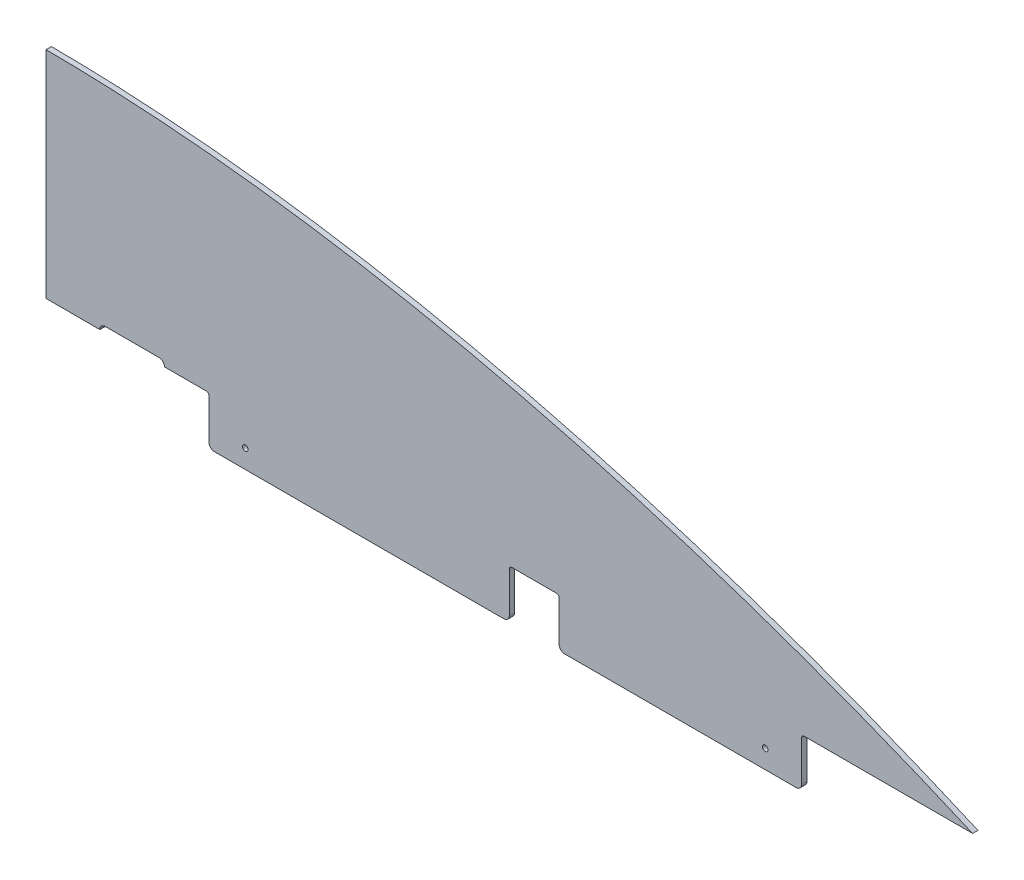
ISO-10303-21;
HEADER;
FILE_DESCRIPTION(('STEP AP214'),'2;1');
FILE_NAME('part.step','',(''),(''),'','','');
FILE_SCHEMA(('AUTOMOTIVE_DESIGN { 1 0 10303 214 1 1 1 1 }'));
ENDSEC;
DATA;
#1=APPLICATION_CONTEXT('core data for automotive mechanical design processes');
#2=APPLICATION_PROTOCOL_DEFINITION('international standard','automotive_design',2000,#1);
#3=PRODUCT_CONTEXT('',#1,'mechanical');
#4=PRODUCT('Part','Part','',(#3));
#5=PRODUCT_RELATED_PRODUCT_CATEGORY('part','',(#4));
#6=PRODUCT_DEFINITION_FORMATION('','',#4);
#7=PRODUCT_DEFINITION_CONTEXT('part definition',#1,'design');
#8=PRODUCT_DEFINITION('design','',#6,#7);
#9=PRODUCT_DEFINITION_SHAPE('','',#8);
#10=(LENGTH_UNIT() NAMED_UNIT(*) SI_UNIT(.MILLI.,.METRE.));
#11=(NAMED_UNIT(*) PLANE_ANGLE_UNIT() SI_UNIT($,.RADIAN.));
#12=(NAMED_UNIT(*) SI_UNIT($,.STERADIAN.) SOLID_ANGLE_UNIT());
#13=UNCERTAINTY_MEASURE_WITH_UNIT(LENGTH_MEASURE(1.E-05),#10,'distance_accuracy_value','');
#14=(GEOMETRIC_REPRESENTATION_CONTEXT(3) GLOBAL_UNCERTAINTY_ASSIGNED_CONTEXT((#13)) GLOBAL_UNIT_ASSIGNED_CONTEXT((#10,
#11,#12)) REPRESENTATION_CONTEXT('',''));
#15=CARTESIAN_POINT('',(0.,0.,0.));
#16=DIRECTION('',(0.,0.,1.));
#17=DIRECTION('',(1.,0.,0.));
#18=AXIS2_PLACEMENT_3D('',#15,#16,#17);
#19=CARTESIAN_POINT('',(566.574596477157,179.041017308607,0.));
#20=DIRECTION('',(0.,0.,1.));
#21=DIRECTION('',(1.,0.,0.));
#22=AXIS2_PLACEMENT_3D('',#19,#20,#21);
#23=PLANE('',#22);
#24=CARTESIAN_POINT('',(234.95,-35.3060000000001,0.));
#25=DIRECTION('',(0.,0.,-1.));
#26=DIRECTION('',(-1.,0.,0.));
#27=AXIS2_PLACEMENT_3D('',#24,#25,#26);
#28=CIRCLE('',#27,3.26389999999993);
#29=CARTESIAN_POINT('',(231.6861,-35.3060000000001,0.));
#30=VERTEX_POINT('',#29);
#31=EDGE_CURVE('E457',#30,#30,#28,.T.);
#32=ORIENTED_EDGE('',*,*,#31,.F.);
#33=EDGE_LOOP('',(#32));
#34=FACE_BOUND('',#33,.T.);
#35=DIRECTION('',(0.,-1.,0.));
#36=VECTOR('',#35,1.);
#37=CARTESIAN_POINT('',(546.1,-57.15,0.));
#38=LINE('',#37,#36);
#39=CARTESIAN_POINT('',(546.1,-3.17499999999999,0.));
#40=VERTEX_POINT('',#39);
#41=CARTESIAN_POINT('',(546.1,-50.8,0.));
#42=VERTEX_POINT('',#41);
#43=EDGE_CURVE('E423',#40,#42,#38,.T.);
#44=ORIENTED_EDGE('',*,*,#43,.T.);
#45=CARTESIAN_POINT('',(539.75,-50.8,0.));
#46=DIRECTION('',(0.,0.,1.));
#47=DIRECTION('',(1.,0.,0.));
#48=AXIS2_PLACEMENT_3D('',#45,#46,#47);
#49=CIRCLE('',#48,6.35);
#50=CARTESIAN_POINT('',(539.75,-57.15,0.));
#51=VERTEX_POINT('',#50);
#52=EDGE_CURVE('E405',#42,#51,#49,.F.);
#53=ORIENTED_EDGE('',*,*,#52,.T.);
#54=DIRECTION('',(-1.,0.,0.));
#55=VECTOR('',#54,1.);
#56=CARTESIAN_POINT('',(192.0875,-57.15,0.));
#57=LINE('',#56,#55);
#58=CARTESIAN_POINT('',(198.4375,-57.15,0.));
#59=VERTEX_POINT('',#58);
#60=EDGE_CURVE('E436',#51,#59,#57,.T.);
#61=ORIENTED_EDGE('',*,*,#60,.T.);
#62=CARTESIAN_POINT('',(198.4375,-50.8,0.));
#63=DIRECTION('',(0.,0.,1.));
#64=DIRECTION('',(1.,0.,0.));
#65=AXIS2_PLACEMENT_3D('',#62,#63,#64);
#66=CIRCLE('',#65,6.35);
#67=CARTESIAN_POINT('',(192.0875,-50.8,0.));
#68=VERTEX_POINT('',#67);
#69=EDGE_CURVE('E53',#59,#68,#66,.F.);
#70=ORIENTED_EDGE('',*,*,#69,.T.);
#71=DIRECTION('',(0.,1.,0.));
#72=VECTOR('',#71,1.);
#73=CARTESIAN_POINT('',(192.0875,0.,0.));
#74=LINE('',#73,#72);
#75=CARTESIAN_POINT('',(192.0875,-3.175,0.));
#76=VERTEX_POINT('',#75);
#77=EDGE_CURVE('E420',#68,#76,#74,.T.);
#78=ORIENTED_EDGE('',*,*,#77,.T.);
#79=CARTESIAN_POINT('',(188.9125,-3.175,0.));
#80=DIRECTION('',(0.,0.,1.));
#81=DIRECTION('',(1.,0.,0.));
#82=AXIS2_PLACEMENT_3D('',#79,#80,#81);
#83=CIRCLE('',#82,3.175);
#84=CARTESIAN_POINT('',(188.9125,0.,0.));
#85=VERTEX_POINT('',#84);
#86=EDGE_CURVE('E194',#76,#85,#83,.T.);
#87=ORIENTED_EDGE('',*,*,#86,.T.);
#88=DIRECTION('',(1.,0.,0.));
#89=VECTOR('',#88,1.);
#90=CARTESIAN_POINT('',(0.,0.,0.));
#91=LINE('',#90,#89);
#92=CARTESIAN_POINT('',(139.7,0.,0.));
#93=VERTEX_POINT('',#92);
#94=EDGE_CURVE('E186',#93,#85,#91,.T.);
#95=ORIENTED_EDGE('',*,*,#94,.F.);
#96=CARTESIAN_POINT('',(133.35,0.,0.));
#97=DIRECTION('',(0.,0.,-1.));
#98=DIRECTION('',(-1.,0.,0.));
#99=AXIS2_PLACEMENT_3D('',#96,#97,#98);
#100=CIRCLE('',#99,6.35000000000017);
#101=CARTESIAN_POINT('',(133.35,6.35000000000018,0.));
#102=VERTEX_POINT('',#101);
#103=EDGE_CURVE('E191',#102,#93,#100,.T.);
#104=ORIENTED_EDGE('',*,*,#103,.F.);
#105=DIRECTION('',(1.,0.,0.));
#106=VECTOR('',#105,1.);
#107=CARTESIAN_POINT('',(69.85,6.35000000000017,0.));
#108=LINE('',#107,#106);
#109=CARTESIAN_POINT('',(69.85,6.35000000000016,0.));
#110=VERTEX_POINT('',#109);
#111=EDGE_CURVE('E220',#110,#102,#108,.T.);
#112=ORIENTED_EDGE('',*,*,#111,.F.);
#113=CARTESIAN_POINT('',(69.85,0.,0.));
#114=DIRECTION('',(0.,0.,-1.));
#115=DIRECTION('',(1.,0.,0.));
#116=AXIS2_PLACEMENT_3D('',#113,#114,#115);
#117=CIRCLE('',#116,6.35000000000008);
#118=CARTESIAN_POINT('',(63.4999999999999,0.,0.));
#119=VERTEX_POINT('',#118);
#120=EDGE_CURVE('E222',#119,#110,#117,.T.);
#121=ORIENTED_EDGE('',*,*,#120,.F.);
#122=CARTESIAN_POINT('',(0.,0.,0.));
#123=VERTEX_POINT('',#122);
#124=EDGE_CURVE('E198',#123,#119,#91,.T.);
#125=ORIENTED_EDGE('',*,*,#124,.F.);
#126=DIRECTION('',(0.,-1.,0.));
#127=VECTOR('',#126,1.);
#128=CARTESIAN_POINT('',(0.,254.,0.));
#129=LINE('',#128,#127);
#130=CARTESIAN_POINT('',(0.,254.,0.));
#131=VERTEX_POINT('',#130);
#132=EDGE_CURVE('E337',#131,#123,#129,.T.);
#133=ORIENTED_EDGE('',*,*,#132,.F.);
#134=CARTESIAN_POINT('',(1092.2,-3.05594159067454E-13,0.));
#135=CARTESIAN_POINT('',(770.285770074945,140.499670678071,0.));
#136=CARTESIAN_POINT('',(376.513153864139,252.276375478215,0.));
#137=CARTESIAN_POINT('',(0.,254.,0.));
#138=B_SPLINE_CURVE_WITH_KNOTS('',3,(#134,#135,#136,#137),.UNSPECIFIED.,.F.,.F.,(4,4),(0.,1.),.UNSPECIFIED.);
#139=CARTESIAN_POINT('',(1092.2,0.,0.));
#140=VERTEX_POINT('',#139);
#141=EDGE_CURVE('E235',#140,#131,#138,.T.);
#142=ORIENTED_EDGE('',*,*,#141,.F.);
#143=CARTESIAN_POINT('',(893.7625,0.,0.));
#144=VERTEX_POINT('',#143);
#145=EDGE_CURVE('E199',#144,#140,#91,.T.);
#146=ORIENTED_EDGE('',*,*,#145,.F.);
#147=CARTESIAN_POINT('',(893.7625,-3.175,0.));
#148=DIRECTION('',(0.,0.,1.));
#149=DIRECTION('',(1.,0.,0.));
#150=AXIS2_PLACEMENT_3D('',#147,#148,#149);
#151=CIRCLE('',#150,3.175);
#152=CARTESIAN_POINT('',(890.5875,-3.175,0.));
#153=VERTEX_POINT('',#152);
#154=EDGE_CURVE('E381',#144,#153,#151,.T.);
#155=ORIENTED_EDGE('',*,*,#154,.T.);
#156=DIRECTION('',(0.,-1.,0.));
#157=VECTOR('',#156,1.);
#158=CARTESIAN_POINT('',(890.5875,0.,0.));
#159=LINE('',#158,#157);
#160=CARTESIAN_POINT('',(890.5875,-50.8,0.));
#161=VERTEX_POINT('',#160);
#162=EDGE_CURVE('E434',#153,#161,#159,.T.);
#163=ORIENTED_EDGE('',*,*,#162,.T.);
#164=CARTESIAN_POINT('',(884.2375,-50.8,0.));
#165=DIRECTION('',(0.,0.,1.));
#166=DIRECTION('',(1.,0.,0.));
#167=AXIS2_PLACEMENT_3D('',#164,#165,#166);
#168=CIRCLE('',#167,6.35);
#169=CARTESIAN_POINT('',(884.2375,-57.15,0.));
#170=VERTEX_POINT('',#169);
#171=EDGE_CURVE('E400',#161,#170,#168,.F.);
#172=ORIENTED_EDGE('',*,*,#171,.T.);
#173=CARTESIAN_POINT('',(611.1875,-57.15,0.));
#174=VERTEX_POINT('',#173);
#175=EDGE_CURVE('E216',#170,#174,#57,.T.);
#176=ORIENTED_EDGE('',*,*,#175,.T.);
#177=CARTESIAN_POINT('',(611.1875,-50.8,0.));
#178=DIRECTION('',(0.,0.,1.));
#179=DIRECTION('',(1.,0.,0.));
#180=AXIS2_PLACEMENT_3D('',#177,#178,#179);
#181=CIRCLE('',#180,6.35);
#182=CARTESIAN_POINT('',(604.8375,-50.8,0.));
#183=VERTEX_POINT('',#182);
#184=EDGE_CURVE('E403',#174,#183,#181,.F.);
#185=ORIENTED_EDGE('',*,*,#184,.T.);
#186=DIRECTION('',(0.,1.,0.));
#187=VECTOR('',#186,1.);
#188=CARTESIAN_POINT('',(604.8375,-57.15,0.));
#189=LINE('',#188,#187);
#190=CARTESIAN_POINT('',(604.8375,-3.175,0.));
#191=VERTEX_POINT('',#190);
#192=EDGE_CURVE('E445',#183,#191,#189,.T.);
#193=ORIENTED_EDGE('',*,*,#192,.T.);
#194=CARTESIAN_POINT('',(601.6625,-3.175,0.));
#195=DIRECTION('',(0.,0.,1.));
#196=DIRECTION('',(1.,0.,0.));
#197=AXIS2_PLACEMENT_3D('',#194,#195,#196);
#198=CIRCLE('',#197,3.175);
#199=CARTESIAN_POINT('',(601.6625,0.,0.));
#200=VERTEX_POINT('',#199);
#201=EDGE_CURVE('E377',#191,#200,#198,.T.);
#202=ORIENTED_EDGE('',*,*,#201,.T.);
#203=DIRECTION('',(-1.,0.,0.));
#204=VECTOR('',#203,1.);
#205=CARTESIAN_POINT('',(604.8375,0.,0.));
#206=LINE('',#205,#204);
#207=CARTESIAN_POINT('',(549.275,0.,0.));
#208=VERTEX_POINT('',#207);
#209=EDGE_CURVE('E428',#200,#208,#206,.T.);
#210=ORIENTED_EDGE('',*,*,#209,.T.);
#211=CARTESIAN_POINT('',(549.275,-3.17499999999999,0.));
#212=DIRECTION('',(0.,0.,1.));
#213=DIRECTION('',(1.,0.,0.));
#214=AXIS2_PLACEMENT_3D('',#211,#212,#213);
#215=CIRCLE('',#214,3.175);
#216=EDGE_CURVE('E372',#208,#40,#215,.T.);
#217=ORIENTED_EDGE('',*,*,#216,.T.);
#218=EDGE_LOOP('',(#44,#53,#61,#70,#78,#87,#95,#104,#112,#121,#125,#133,#142,#146,#155,#163,
#172,#176,#185,#193,#202,#210,#217));
#219=FACE_BOUND('',#218,.T.);
#220=CARTESIAN_POINT('',(847.725,-35.3060000000001,0.));
#221=DIRECTION('',(0.,0.,-1.));
#222=DIRECTION('',(-1.,0.,0.));
#223=AXIS2_PLACEMENT_3D('',#220,#221,#222);
#224=CIRCLE('',#223,3.26389999999999);
#225=CARTESIAN_POINT('',(844.4611,-35.3060000000001,0.));
#226=VERTEX_POINT('',#225);
#227=EDGE_CURVE('E463',#226,#226,#224,.T.);
#228=ORIENTED_EDGE('',*,*,#227,.F.);
#229=EDGE_LOOP('',(#228));
#230=FACE_BOUND('',#229,.T.);
#231=ADVANCED_FACE('F32',(#34,#219,#230),#23,.F.);
#232=CARTESIAN_POINT('',(192.0875,-57.15,-700.834054894595));
#233=DIRECTION('',(0.,-1.,0.));
#234=DIRECTION('',(0.,0.,-1.));
#235=AXIS2_PLACEMENT_3D('',#232,#233,#234);
#236=PLANE('',#235);
#237=DIRECTION('',(1.,0.,0.));
#238=VECTOR('',#237,1.);
#239=CARTESIAN_POINT('',(192.0875,-57.15,6.35));
#240=LINE('',#239,#238);
#241=CARTESIAN_POINT('',(611.1875,-57.15,6.35));
#242=VERTEX_POINT('',#241);
#243=CARTESIAN_POINT('',(884.2375,-57.15,6.35));
#244=VERTEX_POINT('',#243);
#245=EDGE_CURVE('E422',#242,#244,#240,.T.);
#246=ORIENTED_EDGE('',*,*,#245,.F.);
#247=DIRECTION('',(0.,0.,1.));
#248=VECTOR('',#247,1.);
#249=CARTESIAN_POINT('',(611.1875,-57.15,0.));
#250=LINE('',#249,#248);
#251=EDGE_CURVE('E413',#242,#174,#250,.F.);
#252=ORIENTED_EDGE('',*,*,#251,.T.);
#253=ORIENTED_EDGE('',*,*,#175,.F.);
#254=DIRECTION('',(0.,0.,1.));
#255=VECTOR('',#254,1.);
#256=CARTESIAN_POINT('',(884.2375,-57.15,-700.834054894595));
#257=LINE('',#256,#255);
#258=EDGE_CURVE('E410',#170,#244,#257,.T.);
#259=ORIENTED_EDGE('',*,*,#258,.T.);
#260=EDGE_LOOP('',(#246,#252,#253,#259));
#261=FACE_BOUND('',#260,.T.);
#262=ADVANCED_FACE('F289',(#261),#236,.T.);
#263=CARTESIAN_POINT('',(0.,0.,6.35));
#264=DIRECTION('',(0.,1.,0.));
#265=DIRECTION('',(0.,0.,1.));
#266=AXIS2_PLACEMENT_3D('',#263,#264,#265);
#267=PLANE('',#266);
#268=ORIENTED_EDGE('',*,*,#94,.T.);
#269=DIRECTION('',(0.,0.,1.));
#270=VECTOR('',#269,1.);
#271=CARTESIAN_POINT('',(188.9125,0.,6.35));
#272=LINE('',#271,#270);
#273=CARTESIAN_POINT('',(188.9125,0.,6.35));
#274=VERTEX_POINT('',#273);
#275=EDGE_CURVE('E365',#85,#274,#272,.T.);
#276=ORIENTED_EDGE('',*,*,#275,.T.);
#277=DIRECTION('',(1.,0.,0.));
#278=VECTOR('',#277,1.);
#279=CARTESIAN_POINT('',(0.,0.,6.35));
#280=LINE('',#279,#278);
#281=CARTESIAN_POINT('',(139.7,0.,6.35));
#282=VERTEX_POINT('',#281);
#283=EDGE_CURVE('E206',#282,#274,#280,.T.);
#284=ORIENTED_EDGE('',*,*,#283,.F.);
#285=DIRECTION('',(0.,0.,1.));
#286=VECTOR('',#285,1.);
#287=CARTESIAN_POINT('',(139.7,0.,0.));
#288=LINE('',#287,#286);
#289=EDGE_CURVE('E203',#93,#282,#288,.T.);
#290=ORIENTED_EDGE('',*,*,#289,.F.);
#291=EDGE_LOOP('',(#268,#276,#284,#290));
#292=FACE_BOUND('',#291,.T.);
#293=ADVANCED_FACE('F204',(#292),#267,.F.);
#294=DIRECTION('',(0.,0.,1.));
#295=VECTOR('',#294,1.);
#296=CARTESIAN_POINT('',(63.5,0.,0.));
#297=LINE('',#296,#295);
#298=CARTESIAN_POINT('',(63.4999999999999,0.,6.35));
#299=VERTEX_POINT('',#298);
#300=EDGE_CURVE('E225',#119,#299,#297,.T.);
#301=ORIENTED_EDGE('',*,*,#300,.T.);
#302=CARTESIAN_POINT('',(0.,0.,6.35));
#303=VERTEX_POINT('',#302);
#304=EDGE_CURVE('E315',#303,#299,#280,.T.);
#305=ORIENTED_EDGE('',*,*,#304,.F.);
#306=DIRECTION('',(0.,0.,-1.));
#307=VECTOR('',#306,1.);
#308=CARTESIAN_POINT('',(0.,0.,6.35));
#309=LINE('',#308,#307);
#310=EDGE_CURVE('E344',#303,#123,#309,.T.);
#311=ORIENTED_EDGE('',*,*,#310,.T.);
#312=ORIENTED_EDGE('',*,*,#124,.T.);
#313=EDGE_LOOP('',(#301,#305,#311,#312));
#314=FACE_BOUND('',#313,.T.);
#315=ADVANCED_FACE('F301',(#314),#267,.F.);
#316=CARTESIAN_POINT('',(893.7625,0.,6.35));
#317=VERTEX_POINT('',#316);
#318=CARTESIAN_POINT('',(1092.2,0.,6.35));
#319=VERTEX_POINT('',#318);
#320=EDGE_CURVE('E324',#317,#319,#280,.T.);
#321=ORIENTED_EDGE('',*,*,#320,.F.);
#322=DIRECTION('',(0.,0.,1.));
#323=VECTOR('',#322,1.);
#324=CARTESIAN_POINT('',(893.7625,0.,6.35));
#325=LINE('',#324,#323);
#326=EDGE_CURVE('E363',#317,#144,#325,.F.);
#327=ORIENTED_EDGE('',*,*,#326,.T.);
#328=ORIENTED_EDGE('',*,*,#145,.T.);
#329=DIRECTION('',(0.,0.,-1.));
#330=VECTOR('',#329,1.);
#331=CARTESIAN_POINT('',(1092.2,0.,6.35));
#332=LINE('',#331,#330);
#333=EDGE_CURVE('E323',#319,#140,#332,.T.);
#334=ORIENTED_EDGE('',*,*,#333,.F.);
#335=EDGE_LOOP('',(#321,#327,#328,#334));
#336=FACE_BOUND('',#335,.T.);
#337=ADVANCED_FACE('F303',(#336),#267,.F.);
#338=CARTESIAN_POINT('',(566.574596477157,179.041017308607,6.35));
#339=DIRECTION('',(0.,0.,1.));
#340=DIRECTION('',(1.,0.,0.));
#341=AXIS2_PLACEMENT_3D('',#338,#339,#340);
#342=PLANE('',#341);
#343=CARTESIAN_POINT('',(847.725,-35.3060000000001,6.34999999999997));
#344=DIRECTION('',(0.,0.,-1.));
#345=DIRECTION('',(-1.,0.,0.));
#346=AXIS2_PLACEMENT_3D('',#343,#344,#345);
#347=CIRCLE('',#346,3.26389999999999);
#348=CARTESIAN_POINT('',(844.4611,-35.3060000000001,6.34999999999997));
#349=VERTEX_POINT('',#348);
#350=EDGE_CURVE('E460',#349,#349,#347,.T.);
#351=ORIENTED_EDGE('',*,*,#350,.T.);
#352=EDGE_LOOP('',(#351));
#353=FACE_BOUND('',#352,.T.);
#354=CARTESIAN_POINT('',(234.95,-35.3060000000001,6.34999999999997));
#355=DIRECTION('',(0.,0.,-1.));
#356=DIRECTION('',(-1.,0.,0.));
#357=AXIS2_PLACEMENT_3D('',#354,#355,#356);
#358=CIRCLE('',#357,3.26389999999993);
#359=CARTESIAN_POINT('',(231.6861,-35.3060000000001,6.34999999999997));
#360=VERTEX_POINT('',#359);
#361=EDGE_CURVE('E450',#360,#360,#358,.T.);
#362=ORIENTED_EDGE('',*,*,#361,.T.);
#363=EDGE_LOOP('',(#362));
#364=FACE_BOUND('',#363,.T.);
#365=CARTESIAN_POINT('',(198.4375,-57.15,6.35));
#366=VERTEX_POINT('',#365);
#367=CARTESIAN_POINT('',(539.75,-57.15,6.35));
#368=VERTEX_POINT('',#367);
#369=EDGE_CURVE('E426',#366,#368,#240,.T.);
#370=ORIENTED_EDGE('',*,*,#369,.T.);
#371=CARTESIAN_POINT('',(539.75,-50.8,6.34999999999997));
#372=DIRECTION('',(0.,0.,1.));
#373=DIRECTION('',(1.,0.,0.));
#374=AXIS2_PLACEMENT_3D('',#371,#372,#373);
#375=CIRCLE('',#374,6.35);
#376=CARTESIAN_POINT('',(546.1,-50.8,6.35));
#377=VERTEX_POINT('',#376);
#378=EDGE_CURVE('E396',#368,#377,#375,.T.);
#379=ORIENTED_EDGE('',*,*,#378,.T.);
#380=DIRECTION('',(0.,-1.,0.));
#381=VECTOR('',#380,1.);
#382=CARTESIAN_POINT('',(546.1,-57.15,6.35));
#383=LINE('',#382,#381);
#384=CARTESIAN_POINT('',(546.1,-3.17499999999999,6.35));
#385=VERTEX_POINT('',#384);
#386=EDGE_CURVE('E442',#385,#377,#383,.T.);
#387=ORIENTED_EDGE('',*,*,#386,.F.);
#388=CARTESIAN_POINT('',(549.275,-3.17499999999999,6.35));
#389=DIRECTION('',(0.,0.,1.));
#390=DIRECTION('',(1.,0.,0.));
#391=AXIS2_PLACEMENT_3D('',#388,#389,#390);
#392=CIRCLE('',#391,3.175);
#393=CARTESIAN_POINT('',(549.275,0.,6.35));
#394=VERTEX_POINT('',#393);
#395=EDGE_CURVE('E370',#385,#394,#392,.F.);
#396=ORIENTED_EDGE('',*,*,#395,.T.);
#397=DIRECTION('',(-1.,0.,0.));
#398=VECTOR('',#397,1.);
#399=CARTESIAN_POINT('',(604.8375,0.,6.35));
#400=LINE('',#399,#398);
#401=CARTESIAN_POINT('',(601.6625,0.,6.35));
#402=VERTEX_POINT('',#401);
#403=EDGE_CURVE('E446',#402,#394,#400,.T.);
#404=ORIENTED_EDGE('',*,*,#403,.F.);
#405=CARTESIAN_POINT('',(601.6625,-3.175,6.35));
#406=DIRECTION('',(0.,0.,1.));
#407=DIRECTION('',(1.,0.,0.));
#408=AXIS2_PLACEMENT_3D('',#405,#406,#407);
#409=CIRCLE('',#408,3.175);
#410=CARTESIAN_POINT('',(604.8375,-3.175,6.35));
#411=VERTEX_POINT('',#410);
#412=EDGE_CURVE('E374',#402,#411,#409,.F.);
#413=ORIENTED_EDGE('',*,*,#412,.T.);
#414=DIRECTION('',(0.,1.,0.));
#415=VECTOR('',#414,1.);
#416=CARTESIAN_POINT('',(604.8375,-57.15,6.35));
#417=LINE('',#416,#415);
#418=CARTESIAN_POINT('',(604.8375,-50.8,6.35));
#419=VERTEX_POINT('',#418);
#420=EDGE_CURVE('E449',#419,#411,#417,.T.);
#421=ORIENTED_EDGE('',*,*,#420,.F.);
#422=CARTESIAN_POINT('',(611.1875,-50.8,6.35));
#423=DIRECTION('',(0.,0.,1.));
#424=DIRECTION('',(1.,0.,0.));
#425=AXIS2_PLACEMENT_3D('',#422,#423,#424);
#426=CIRCLE('',#425,6.35);
#427=EDGE_CURVE('E394',#419,#242,#426,.T.);
#428=ORIENTED_EDGE('',*,*,#427,.T.);
#429=ORIENTED_EDGE('',*,*,#245,.T.);
#430=CARTESIAN_POINT('',(884.2375,-50.8,6.34999999999997));
#431=DIRECTION('',(0.,0.,1.));
#432=DIRECTION('',(1.,0.,0.));
#433=AXIS2_PLACEMENT_3D('',#430,#431,#432);
#434=CIRCLE('',#433,6.35);
#435=CARTESIAN_POINT('',(890.5875,-50.8,6.35));
#436=VERTEX_POINT('',#435);
#437=EDGE_CURVE('E390',#244,#436,#434,.T.);
#438=ORIENTED_EDGE('',*,*,#437,.T.);
#439=DIRECTION('',(0.,1.,0.));
#440=VECTOR('',#439,1.);
#441=CARTESIAN_POINT('',(890.5875,0.,6.35));
#442=LINE('',#441,#440);
#443=CARTESIAN_POINT('',(890.5875,-3.175,6.35));
#444=VERTEX_POINT('',#443);
#445=EDGE_CURVE('E433',#436,#444,#442,.T.);
#446=ORIENTED_EDGE('',*,*,#445,.T.);
#447=CARTESIAN_POINT('',(893.7625,-3.175,6.34999999999997));
#448=DIRECTION('',(0.,0.,1.));
#449=DIRECTION('',(1.,0.,0.));
#450=AXIS2_PLACEMENT_3D('',#447,#448,#449);
#451=CIRCLE('',#450,3.175);
#452=EDGE_CURVE('E379',#444,#317,#451,.F.);
#453=ORIENTED_EDGE('',*,*,#452,.T.);
#454=ORIENTED_EDGE('',*,*,#320,.T.);
#455=CARTESIAN_POINT('',(1092.2,-3.05594159067454E-13,6.35));
#456=CARTESIAN_POINT('',(770.285770074945,140.499670678071,6.35));
#457=CARTESIAN_POINT('',(376.513153864139,252.276375478215,6.35));
#458=CARTESIAN_POINT('',(0.,254.,6.35));
#459=B_SPLINE_CURVE_WITH_KNOTS('',3,(#455,#456,#457,#458),.UNSPECIFIED.,.F.,.F.,(4,4),(0.,1.),.UNSPECIFIED.);
#460=CARTESIAN_POINT('',(0.,254.,6.35));
#461=VERTEX_POINT('',#460);
#462=EDGE_CURVE('E236',#319,#461,#459,.T.);
#463=ORIENTED_EDGE('',*,*,#462,.T.);
#464=DIRECTION('',(0.,-1.,0.));
#465=VECTOR('',#464,1.);
#466=CARTESIAN_POINT('',(0.,254.,6.35));
#467=LINE('',#466,#465);
#468=EDGE_CURVE('E242',#461,#303,#467,.T.);
#469=ORIENTED_EDGE('',*,*,#468,.T.);
#470=ORIENTED_EDGE('',*,*,#304,.T.);
#471=CARTESIAN_POINT('',(69.85,0.,6.35));
#472=DIRECTION('',(0.,0.,1.));
#473=DIRECTION('',(1.,0.,0.));
#474=AXIS2_PLACEMENT_3D('',#471,#472,#473);
#475=CIRCLE('',#474,6.35000000000008);
#476=CARTESIAN_POINT('',(69.85,6.35000000000016,6.35));
#477=VERTEX_POINT('',#476);
#478=EDGE_CURVE('E233',#299,#477,#475,.F.);
#479=ORIENTED_EDGE('',*,*,#478,.T.);
#480=DIRECTION('',(1.,0.,0.));
#481=VECTOR('',#480,1.);
#482=CARTESIAN_POINT('',(566.574596477157,6.35000000000027,6.35));
#483=LINE('',#482,#481);
#484=CARTESIAN_POINT('',(133.35,6.35000000000018,6.35));
#485=VERTEX_POINT('',#484);
#486=EDGE_CURVE('E231',#477,#485,#483,.T.);
#487=ORIENTED_EDGE('',*,*,#486,.T.);
#488=CARTESIAN_POINT('',(133.35,0.,6.35));
#489=DIRECTION('',(0.,0.,1.));
#490=DIRECTION('',(1.,0.,0.));
#491=AXIS2_PLACEMENT_3D('',#488,#489,#490);
#492=CIRCLE('',#491,6.35000000000017);
#493=EDGE_CURVE('E224',#485,#282,#492,.F.);
#494=ORIENTED_EDGE('',*,*,#493,.T.);
#495=ORIENTED_EDGE('',*,*,#283,.T.);
#496=CARTESIAN_POINT('',(188.9125,-3.175,6.35));
#497=DIRECTION('',(0.,0.,1.));
#498=DIRECTION('',(1.,0.,0.));
#499=AXIS2_PLACEMENT_3D('',#496,#497,#498);
#500=CIRCLE('',#499,3.175);
#501=CARTESIAN_POINT('',(192.0875,-3.175,6.35));
#502=VERTEX_POINT('',#501);
#503=EDGE_CURVE('E330',#274,#502,#500,.F.);
#504=ORIENTED_EDGE('',*,*,#503,.T.);
#505=DIRECTION('',(0.,-1.,0.));
#506=VECTOR('',#505,1.);
#507=CARTESIAN_POINT('',(192.0875,0.,6.35));
#508=LINE('',#507,#506);
#509=CARTESIAN_POINT('',(192.0875,-50.8,6.35));
#510=VERTEX_POINT('',#509);
#511=EDGE_CURVE('E418',#502,#510,#508,.T.);
#512=ORIENTED_EDGE('',*,*,#511,.T.);
#513=CARTESIAN_POINT('',(198.4375,-50.8,6.34999999999997));
#514=DIRECTION('',(0.,0.,1.));
#515=DIRECTION('',(1.,0.,0.));
#516=AXIS2_PLACEMENT_3D('',#513,#514,#515);
#517=CIRCLE('',#516,6.35);
#518=EDGE_CURVE('E392',#510,#366,#517,.T.);
#519=ORIENTED_EDGE('',*,*,#518,.T.);
#520=EDGE_LOOP('',(#370,#379,#387,#396,#404,#413,#421,#428,#429,#438,#446,#453,#454,#463,#469,
#470,#479,#487,#494,#495,#504,#512,#519));
#521=FACE_BOUND('',#520,.T.);
#522=ADVANCED_FACE('F253',(#353,#364,#521),#342,.T.);
#523=DIRECTION('',(0.,0.,-1.));
#524=VECTOR('',#523,1.);
#525=SURFACE_OF_LINEAR_EXTRUSION('',#459,#524);
#526=ORIENTED_EDGE('',*,*,#141,.T.);
#527=DIRECTION('',(0.,0.,-1.));
#528=VECTOR('',#527,1.);
#529=CARTESIAN_POINT('',(0.,254.,6.35));
#530=LINE('',#529,#528);
#531=EDGE_CURVE('E346',#461,#131,#530,.T.);
#532=ORIENTED_EDGE('',*,*,#531,.F.);
#533=ORIENTED_EDGE('',*,*,#462,.F.);
#534=ORIENTED_EDGE('',*,*,#333,.T.);
#535=EDGE_LOOP('',(#526,#532,#533,#534));
#536=FACE_BOUND('',#535,.T.);
#537=ADVANCED_FACE('F248',(#536),#525,.F.);
#538=CARTESIAN_POINT('',(0.,254.,6.35));
#539=DIRECTION('',(1.,0.,0.));
#540=DIRECTION('',(0.,1.,0.));
#541=AXIS2_PLACEMENT_3D('',#538,#539,#540);
#542=PLANE('',#541);
#543=ORIENTED_EDGE('',*,*,#132,.T.);
#544=ORIENTED_EDGE('',*,*,#310,.F.);
#545=ORIENTED_EDGE('',*,*,#468,.F.);
#546=ORIENTED_EDGE('',*,*,#531,.T.);
#547=EDGE_LOOP('',(#543,#544,#545,#546));
#548=FACE_BOUND('',#547,.T.);
#549=ADVANCED_FACE('F252',(#548),#542,.F.);
#550=CARTESIAN_POINT('',(69.85,0.,0.));
#551=DIRECTION('',(0.,0.,1.));
#552=DIRECTION('',(1.,0.,0.));
#553=AXIS2_PLACEMENT_3D('',#550,#551,#552);
#554=CYLINDRICAL_SURFACE('',#553,6.35000000000008);
#555=ORIENTED_EDGE('',*,*,#478,.F.);
#556=ORIENTED_EDGE('',*,*,#300,.F.);
#557=ORIENTED_EDGE('',*,*,#120,.T.);
#558=DIRECTION('',(0.,0.,1.));
#559=VECTOR('',#558,1.);
#560=CARTESIAN_POINT('',(69.85,6.35000000000008,0.));
#561=LINE('',#560,#559);
#562=EDGE_CURVE('E209',#110,#477,#561,.T.);
#563=ORIENTED_EDGE('',*,*,#562,.T.);
#564=EDGE_LOOP('',(#555,#556,#557,#563));
#565=FACE_BOUND('',#564,.T.);
#566=ADVANCED_FACE('F325',(#565),#554,.F.);
#567=CARTESIAN_POINT('',(69.85,6.35000000000017,0.));
#568=DIRECTION('',(0.,-1.,0.));
#569=DIRECTION('',(1.,0.,0.));
#570=AXIS2_PLACEMENT_3D('',#567,#568,#569);
#571=PLANE('',#570);
#572=ORIENTED_EDGE('',*,*,#486,.F.);
#573=ORIENTED_EDGE('',*,*,#562,.F.);
#574=ORIENTED_EDGE('',*,*,#111,.T.);
#575=DIRECTION('',(0.,0.,1.));
#576=VECTOR('',#575,1.);
#577=CARTESIAN_POINT('',(133.35,6.35000000000019,0.));
#578=LINE('',#577,#576);
#579=EDGE_CURVE('E213',#102,#485,#578,.T.);
#580=ORIENTED_EDGE('',*,*,#579,.T.);
#581=EDGE_LOOP('',(#572,#573,#574,#580));
#582=FACE_BOUND('',#581,.T.);
#583=ADVANCED_FACE('F328',(#582),#571,.T.);
#584=CARTESIAN_POINT('',(133.35,0.,0.));
#585=DIRECTION('',(0.,0.,1.));
#586=DIRECTION('',(1.,0.,0.));
#587=AXIS2_PLACEMENT_3D('',#584,#585,#586);
#588=CYLINDRICAL_SURFACE('',#587,6.35000000000017);
#589=ORIENTED_EDGE('',*,*,#493,.F.);
#590=ORIENTED_EDGE('',*,*,#579,.F.);
#591=ORIENTED_EDGE('',*,*,#103,.T.);
#592=ORIENTED_EDGE('',*,*,#289,.T.);
#593=EDGE_LOOP('',(#589,#590,#591,#592));
#594=FACE_BOUND('',#593,.T.);
#595=ADVANCED_FACE('F211',(#594),#588,.F.);
#596=CARTESIAN_POINT('',(192.0875,0.,-700.834054894595));
#597=DIRECTION('',(-1.,0.,0.));
#598=DIRECTION('',(0.,0.,1.));
#599=AXIS2_PLACEMENT_3D('',#596,#597,#598);
#600=PLANE('',#599);
#601=ORIENTED_EDGE('',*,*,#77,.F.);
#602=DIRECTION('',(0.,0.,1.));
#603=VECTOR('',#602,1.);
#604=CARTESIAN_POINT('',(192.0875,-50.8,-700.834054894595));
#605=LINE('',#604,#603);
#606=EDGE_CURVE('E40',#68,#510,#605,.T.);
#607=ORIENTED_EDGE('',*,*,#606,.T.);
#608=ORIENTED_EDGE('',*,*,#511,.F.);
#609=DIRECTION('',(0.,0.,1.));
#610=VECTOR('',#609,1.);
#611=CARTESIAN_POINT('',(192.0875,-3.175,-700.834054894595));
#612=LINE('',#611,#610);
#613=EDGE_CURVE('E367',#502,#76,#612,.F.);
#614=ORIENTED_EDGE('',*,*,#613,.T.);
#615=EDGE_LOOP('',(#601,#607,#608,#614));
#616=FACE_BOUND('',#615,.T.);
#617=ADVANCED_FACE('F417',(#616),#600,.T.);
#618=CARTESIAN_POINT('',(890.5875,0.,-700.834054894595));
#619=DIRECTION('',(1.,0.,0.));
#620=DIRECTION('',(0.,0.,-1.));
#621=AXIS2_PLACEMENT_3D('',#618,#619,#620);
#622=PLANE('',#621);
#623=ORIENTED_EDGE('',*,*,#445,.F.);
#624=DIRECTION('',(0.,0.,1.));
#625=VECTOR('',#624,1.);
#626=CARTESIAN_POINT('',(890.5875,-50.8,-700.834054894595));
#627=LINE('',#626,#625);
#628=EDGE_CURVE('E11',#436,#161,#627,.F.);
#629=ORIENTED_EDGE('',*,*,#628,.T.);
#630=ORIENTED_EDGE('',*,*,#162,.F.);
#631=DIRECTION('',(0.,0.,1.));
#632=VECTOR('',#631,1.);
#633=CARTESIAN_POINT('',(890.5875,-3.175,-700.834054894595));
#634=LINE('',#633,#632);
#635=EDGE_CURVE('E360',#153,#444,#634,.T.);
#636=ORIENTED_EDGE('',*,*,#635,.T.);
#637=EDGE_LOOP('',(#623,#629,#630,#636));
#638=FACE_BOUND('',#637,.T.);
#639=ADVANCED_FACE('F489',(#638),#622,.T.);
#640=ORIENTED_EDGE('',*,*,#60,.F.);
#641=DIRECTION('',(0.,0.,1.));
#642=VECTOR('',#641,1.);
#643=CARTESIAN_POINT('',(539.75,-57.15,6.34999999999997));
#644=LINE('',#643,#642);
#645=EDGE_CURVE('E387',#51,#368,#644,.T.);
#646=ORIENTED_EDGE('',*,*,#645,.T.);
#647=ORIENTED_EDGE('',*,*,#369,.F.);
#648=DIRECTION('',(0.,0.,1.));
#649=VECTOR('',#648,1.);
#650=CARTESIAN_POINT('',(198.4375,-57.15,-700.834054894595));
#651=LINE('',#650,#649);
#652=EDGE_CURVE('E385',#366,#59,#651,.F.);
#653=ORIENTED_EDGE('',*,*,#652,.T.);
#654=EDGE_LOOP('',(#640,#646,#647,#653));
#655=FACE_BOUND('',#654,.T.);
#656=ADVANCED_FACE('F297',(#655),#236,.T.);
#657=CARTESIAN_POINT('',(604.8375,-57.15,0.));
#658=DIRECTION('',(1.,0.,0.));
#659=DIRECTION('',(0.,0.,-1.));
#660=AXIS2_PLACEMENT_3D('',#657,#658,#659);
#661=PLANE('',#660);
#662=ORIENTED_EDGE('',*,*,#192,.F.);
#663=DIRECTION('',(0.,0.,1.));
#664=VECTOR('',#663,1.);
#665=CARTESIAN_POINT('',(604.8375,-50.8,6.35));
#666=LINE('',#665,#664);
#667=EDGE_CURVE('E407',#183,#419,#666,.T.);
#668=ORIENTED_EDGE('',*,*,#667,.T.);
#669=ORIENTED_EDGE('',*,*,#420,.T.);
#670=DIRECTION('',(0.,0.,1.));
#671=VECTOR('',#670,1.);
#672=CARTESIAN_POINT('',(604.8375,-3.175,0.));
#673=LINE('',#672,#671);
#674=EDGE_CURVE('E357',#411,#191,#673,.F.);
#675=ORIENTED_EDGE('',*,*,#674,.T.);
#676=EDGE_LOOP('',(#662,#668,#669,#675));
#677=FACE_BOUND('',#676,.T.);
#678=ADVANCED_FACE('F481',(#677),#661,.F.);
#679=CARTESIAN_POINT('',(546.1,-57.15,0.));
#680=DIRECTION('',(-1.,0.,0.));
#681=DIRECTION('',(0.,0.,1.));
#682=AXIS2_PLACEMENT_3D('',#679,#680,#681);
#683=PLANE('',#682);
#684=ORIENTED_EDGE('',*,*,#386,.T.);
#685=DIRECTION('',(0.,0.,1.));
#686=VECTOR('',#685,1.);
#687=CARTESIAN_POINT('',(546.1,-50.8,0.));
#688=LINE('',#687,#686);
#689=EDGE_CURVE('E398',#377,#42,#688,.F.);
#690=ORIENTED_EDGE('',*,*,#689,.T.);
#691=ORIENTED_EDGE('',*,*,#43,.F.);
#692=DIRECTION('',(0.,0.,1.));
#693=VECTOR('',#692,1.);
#694=CARTESIAN_POINT('',(546.1,-3.17499999999999,6.35));
#695=LINE('',#694,#693);
#696=EDGE_CURVE('E349',#40,#385,#695,.T.);
#697=ORIENTED_EDGE('',*,*,#696,.T.);
#698=EDGE_LOOP('',(#684,#690,#691,#697));
#699=FACE_BOUND('',#698,.T.);
#700=ADVANCED_FACE('F478',(#699),#683,.F.);
#701=CARTESIAN_POINT('',(604.8375,0.,0.));
#702=DIRECTION('',(0.,1.,0.));
#703=DIRECTION('',(-1.,0.,0.));
#704=AXIS2_PLACEMENT_3D('',#701,#702,#703);
#705=PLANE('',#704);
#706=ORIENTED_EDGE('',*,*,#403,.T.);
#707=DIRECTION('',(0.,0.,1.));
#708=VECTOR('',#707,1.);
#709=CARTESIAN_POINT('',(549.275,0.,0.));
#710=LINE('',#709,#708);
#711=EDGE_CURVE('E355',#394,#208,#710,.F.);
#712=ORIENTED_EDGE('',*,*,#711,.T.);
#713=ORIENTED_EDGE('',*,*,#209,.F.);
#714=DIRECTION('',(0.,0.,1.));
#715=VECTOR('',#714,1.);
#716=CARTESIAN_POINT('',(601.6625,0.,6.35));
#717=LINE('',#716,#715);
#718=EDGE_CURVE('E352',#200,#402,#717,.T.);
#719=ORIENTED_EDGE('',*,*,#718,.T.);
#720=EDGE_LOOP('',(#706,#712,#713,#719));
#721=FACE_BOUND('',#720,.T.);
#722=ADVANCED_FACE('F260',(#721),#705,.F.);
#723=CARTESIAN_POINT('',(549.275,-3.17499999999999,0.));
#724=DIRECTION('',(0.,0.,-1.));
#725=DIRECTION('',(-1.,0.,0.));
#726=AXIS2_PLACEMENT_3D('',#723,#724,#725);
#727=CYLINDRICAL_SURFACE('',#726,3.175);
#728=ORIENTED_EDGE('',*,*,#216,.F.);
#729=ORIENTED_EDGE('',*,*,#711,.F.);
#730=ORIENTED_EDGE('',*,*,#395,.F.);
#731=ORIENTED_EDGE('',*,*,#696,.F.);
#732=EDGE_LOOP('',(#728,#729,#730,#731));
#733=FACE_BOUND('',#732,.T.);
#734=ADVANCED_FACE('F256',(#733),#727,.F.);
#735=CARTESIAN_POINT('',(601.6625,-3.175,0.));
#736=DIRECTION('',(0.,0.,-1.));
#737=DIRECTION('',(-1.,0.,0.));
#738=AXIS2_PLACEMENT_3D('',#735,#736,#737);
#739=CYLINDRICAL_SURFACE('',#738,3.175);
#740=ORIENTED_EDGE('',*,*,#201,.F.);
#741=ORIENTED_EDGE('',*,*,#674,.F.);
#742=ORIENTED_EDGE('',*,*,#412,.F.);
#743=ORIENTED_EDGE('',*,*,#718,.F.);
#744=EDGE_LOOP('',(#740,#741,#742,#743));
#745=FACE_BOUND('',#744,.T.);
#746=ADVANCED_FACE('F259',(#745),#739,.F.);
#747=CARTESIAN_POINT('',(893.7625,-3.175,-700.834054894595));
#748=DIRECTION('',(0.,0.,1.));
#749=DIRECTION('',(1.,0.,0.));
#750=AXIS2_PLACEMENT_3D('',#747,#748,#749);
#751=CYLINDRICAL_SURFACE('',#750,3.175);
#752=ORIENTED_EDGE('',*,*,#154,.F.);
#753=ORIENTED_EDGE('',*,*,#326,.F.);
#754=ORIENTED_EDGE('',*,*,#452,.F.);
#755=ORIENTED_EDGE('',*,*,#635,.F.);
#756=EDGE_LOOP('',(#752,#753,#754,#755));
#757=FACE_BOUND('',#756,.T.);
#758=ADVANCED_FACE('F264',(#757),#751,.F.);
#759=CARTESIAN_POINT('',(188.9125,-3.175,6.35));
#760=DIRECTION('',(0.,0.,1.));
#761=DIRECTION('',(1.,0.,0.));
#762=AXIS2_PLACEMENT_3D('',#759,#760,#761);
#763=CYLINDRICAL_SURFACE('',#762,3.175);
#764=ORIENTED_EDGE('',*,*,#86,.F.);
#765=ORIENTED_EDGE('',*,*,#613,.F.);
#766=ORIENTED_EDGE('',*,*,#503,.F.);
#767=ORIENTED_EDGE('',*,*,#275,.F.);
#768=EDGE_LOOP('',(#764,#765,#766,#767));
#769=FACE_BOUND('',#768,.T.);
#770=ADVANCED_FACE('F268',(#769),#763,.F.);
#771=CARTESIAN_POINT('',(539.75,-50.8,-700.834054894595));
#772=DIRECTION('',(0.,0.,-1.));
#773=DIRECTION('',(-1.,0.,0.));
#774=AXIS2_PLACEMENT_3D('',#771,#772,#773);
#775=CYLINDRICAL_SURFACE('',#774,6.35);
#776=ORIENTED_EDGE('',*,*,#52,.F.);
#777=ORIENTED_EDGE('',*,*,#689,.F.);
#778=ORIENTED_EDGE('',*,*,#378,.F.);
#779=ORIENTED_EDGE('',*,*,#645,.F.);
#780=EDGE_LOOP('',(#776,#777,#778,#779));
#781=FACE_BOUND('',#780,.T.);
#782=ADVANCED_FACE('F272',(#781),#775,.T.);
#783=CARTESIAN_POINT('',(611.1875,-50.8,0.));
#784=DIRECTION('',(0.,0.,-1.));
#785=DIRECTION('',(-1.,0.,0.));
#786=AXIS2_PLACEMENT_3D('',#783,#784,#785);
#787=CYLINDRICAL_SURFACE('',#786,6.35);
#788=ORIENTED_EDGE('',*,*,#184,.F.);
#789=ORIENTED_EDGE('',*,*,#251,.F.);
#790=ORIENTED_EDGE('',*,*,#427,.F.);
#791=ORIENTED_EDGE('',*,*,#667,.F.);
#792=EDGE_LOOP('',(#788,#789,#790,#791));
#793=FACE_BOUND('',#792,.T.);
#794=ADVANCED_FACE('F276',(#793),#787,.T.);
#795=CARTESIAN_POINT('',(198.4375,-50.8,-700.834054894595));
#796=DIRECTION('',(0.,0.,1.));
#797=DIRECTION('',(1.,0.,0.));
#798=AXIS2_PLACEMENT_3D('',#795,#796,#797);
#799=CYLINDRICAL_SURFACE('',#798,6.35);
#800=ORIENTED_EDGE('',*,*,#69,.F.);
#801=ORIENTED_EDGE('',*,*,#652,.F.);
#802=ORIENTED_EDGE('',*,*,#518,.F.);
#803=ORIENTED_EDGE('',*,*,#606,.F.);
#804=EDGE_LOOP('',(#800,#801,#802,#803));
#805=FACE_BOUND('',#804,.T.);
#806=ADVANCED_FACE('F279',(#805),#799,.T.);
#807=CARTESIAN_POINT('',(884.2375,-50.8,-700.834054894595));
#808=DIRECTION('',(0.,0.,1.));
#809=DIRECTION('',(1.,0.,0.));
#810=AXIS2_PLACEMENT_3D('',#807,#808,#809);
#811=CYLINDRICAL_SURFACE('',#810,6.35);
#812=ORIENTED_EDGE('',*,*,#171,.F.);
#813=ORIENTED_EDGE('',*,*,#628,.F.);
#814=ORIENTED_EDGE('',*,*,#437,.F.);
#815=ORIENTED_EDGE('',*,*,#258,.F.);
#816=EDGE_LOOP('',(#812,#813,#814,#815));
#817=FACE_BOUND('',#816,.T.);
#818=ADVANCED_FACE('F34',(#817),#811,.T.);
#819=CARTESIAN_POINT('',(234.95,-35.3060000000001,0.));
#820=DIRECTION('',(0.,0.,-1.));
#821=DIRECTION('',(-1.,0.,0.));
#822=AXIS2_PLACEMENT_3D('',#819,#820,#821);
#823=CYLINDRICAL_SURFACE('',#822,3.26389999999993);
#824=ORIENTED_EDGE('',*,*,#361,.F.);
#825=EDGE_LOOP('',(#824));
#826=FACE_BOUND('',#825,.T.);
#827=ORIENTED_EDGE('',*,*,#31,.T.);
#828=EDGE_LOOP('',(#827));
#829=FACE_BOUND('',#828,.T.);
#830=ADVANCED_FACE('F286',(#826,#829),#823,.F.);
#831=CARTESIAN_POINT('',(847.725,-35.3060000000001,0.));
#832=DIRECTION('',(0.,0.,-1.));
#833=DIRECTION('',(-1.,0.,0.));
#834=AXIS2_PLACEMENT_3D('',#831,#832,#833);
#835=CYLINDRICAL_SURFACE('',#834,3.26389999999999);
#836=ORIENTED_EDGE('',*,*,#350,.F.);
#837=EDGE_LOOP('',(#836));
#838=FACE_BOUND('',#837,.T.);
#839=ORIENTED_EDGE('',*,*,#227,.T.);
#840=EDGE_LOOP('',(#839));
#841=FACE_BOUND('',#840,.T.);
#842=ADVANCED_FACE('F467',(#838,#841),#835,.F.);
#843=CLOSED_SHELL('',(#231,#262,#293,#315,#337,#522,#537,#549,#566,#583,#595,#617,#639,#656,
#678,#700,#722,#734,#746,#758,#770,#782,#794,#806,#818,#830,#842));
#844=MANIFOLD_SOLID_BREP('B2',#843);
#845=ADVANCED_BREP_SHAPE_REPRESENTATION('',(#18,#844),#14);
#846=SHAPE_DEFINITION_REPRESENTATION(#9,#845);
ENDSEC;
END-ISO-10303-21;
